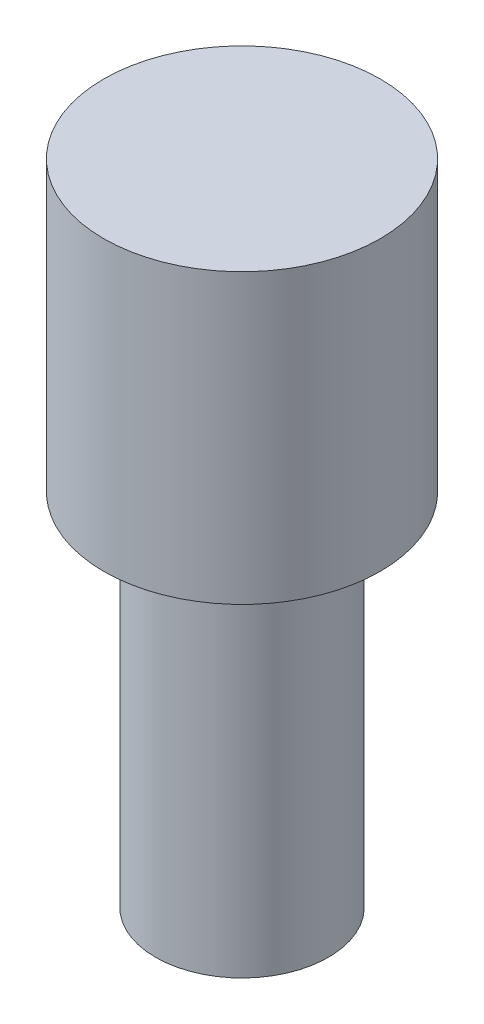
ISO-10303-21;
HEADER;
FILE_DESCRIPTION(('STEP AP214'),'2;1');
FILE_NAME('part.step','',(''),(''),'','','');
FILE_SCHEMA(('AUTOMOTIVE_DESIGN { 1 0 10303 214 1 1 1 1 }'));
ENDSEC;
DATA;
#1=APPLICATION_CONTEXT('core data for automotive mechanical design processes');
#2=APPLICATION_PROTOCOL_DEFINITION('international standard','automotive_design',2000,#1);
#3=PRODUCT_CONTEXT('',#1,'mechanical');
#4=PRODUCT('Part','Part','',(#3));
#5=PRODUCT_RELATED_PRODUCT_CATEGORY('part','',(#4));
#6=PRODUCT_DEFINITION_FORMATION('','',#4);
#7=PRODUCT_DEFINITION_CONTEXT('part definition',#1,'design');
#8=PRODUCT_DEFINITION('design','',#6,#7);
#9=PRODUCT_DEFINITION_SHAPE('','',#8);
#10=(LENGTH_UNIT() NAMED_UNIT(*) SI_UNIT(.MILLI.,.METRE.));
#11=(NAMED_UNIT(*) PLANE_ANGLE_UNIT() SI_UNIT($,.RADIAN.));
#12=(NAMED_UNIT(*) SI_UNIT($,.STERADIAN.) SOLID_ANGLE_UNIT());
#13=UNCERTAINTY_MEASURE_WITH_UNIT(LENGTH_MEASURE(1.E-05),#10,'distance_accuracy_value','');
#14=(GEOMETRIC_REPRESENTATION_CONTEXT(3) GLOBAL_UNCERTAINTY_ASSIGNED_CONTEXT((#13)) GLOBAL_UNIT_ASSIGNED_CONTEXT((#10,
#11,#12)) REPRESENTATION_CONTEXT('',''));
#15=CARTESIAN_POINT('',(0.,0.,0.));
#16=DIRECTION('',(0.,0.,1.));
#17=DIRECTION('',(1.,0.,0.));
#18=AXIS2_PLACEMENT_3D('',#15,#16,#17);
#19=CARTESIAN_POINT('',(0.,0.,-1.21920000000001));
#20=DIRECTION('',(0.,1.,0.));
#21=DIRECTION('',(0.,0.,1.));
#22=AXIS2_PLACEMENT_3D('',#19,#20,#21);
#23=PLANE('',#22);
#24=CARTESIAN_POINT('',(0.,0.,0.));
#25=DIRECTION('',(0.,1.,0.));
#26=DIRECTION('',(0.,0.,1.));
#27=AXIS2_PLACEMENT_3D('',#24,#25,#26);
#28=CIRCLE('',#27,1.2192);
#29=CARTESIAN_POINT('',(0.,0.,1.21919999999999));
#30=VERTEX_POINT('',#29);
#31=EDGE_CURVE('E10',#30,#30,#28,.T.);
#32=ORIENTED_EDGE('',*,*,#31,.F.);
#33=EDGE_LOOP('',(#32));
#34=FACE_BOUND('',#33,.T.);
#35=CARTESIAN_POINT('',(0.,0.,0.));
#36=DIRECTION('',(0.,1.,0.));
#37=DIRECTION('',(0.,0.,1.));
#38=AXIS2_PLACEMENT_3D('',#35,#36,#37);
#39=CIRCLE('',#38,0.761999999999997);
#40=CARTESIAN_POINT('',(0.,0.,0.761999999999988));
#41=VERTEX_POINT('',#40);
#42=EDGE_CURVE('E47',#41,#41,#39,.T.);
#43=ORIENTED_EDGE('',*,*,#42,.T.);
#44=EDGE_LOOP('',(#43));
#45=FACE_BOUND('',#44,.T.);
#46=ADVANCED_FACE('F33',(#34,#45),#23,.F.);
#47=CARTESIAN_POINT('',(0.,53.7786417659091,0.));
#48=DIRECTION('',(0.,1.,0.));
#49=DIRECTION('',(0.,0.,1.));
#50=AXIS2_PLACEMENT_3D('',#47,#48,#49);
#51=CYLINDRICAL_SURFACE('',#50,1.2192);
#52=CARTESIAN_POINT('',(0.,2.54,0.));
#53=DIRECTION('',(0.,1.,0.));
#54=DIRECTION('',(0.,0.,1.));
#55=AXIS2_PLACEMENT_3D('',#52,#53,#54);
#56=CIRCLE('',#55,1.2192);
#57=CARTESIAN_POINT('',(0.,2.54,1.21919999999999));
#58=VERTEX_POINT('',#57);
#59=EDGE_CURVE('E39',#58,#58,#56,.T.);
#60=ORIENTED_EDGE('',*,*,#59,.F.);
#61=EDGE_LOOP('',(#60));
#62=FACE_BOUND('',#61,.T.);
#63=ORIENTED_EDGE('',*,*,#31,.T.);
#64=EDGE_LOOP('',(#63));
#65=FACE_BOUND('',#64,.T.);
#66=ADVANCED_FACE('F67',(#62,#65),#51,.T.);
#67=CARTESIAN_POINT('',(0.,2.54,0.));
#68=DIRECTION('',(0.,-1.,0.));
#69=DIRECTION('',(0.,0.,-1.));
#70=AXIS2_PLACEMENT_3D('',#67,#68,#69);
#71=PLANE('',#70);
#72=ORIENTED_EDGE('',*,*,#59,.T.);
#73=EDGE_LOOP('',(#72));
#74=FACE_BOUND('',#73,.T.);
#75=ADVANCED_FACE('F62',(#74),#71,.F.);
#76=CARTESIAN_POINT('',(0.,-3.175,-0.762000000000007));
#77=DIRECTION('',(0.,1.,0.));
#78=DIRECTION('',(0.,0.,1.));
#79=AXIS2_PLACEMENT_3D('',#76,#77,#78);
#80=PLANE('',#79);
#81=CARTESIAN_POINT('',(0.,-3.175,0.));
#82=DIRECTION('',(0.,1.,0.));
#83=DIRECTION('',(0.,0.,1.));
#84=AXIS2_PLACEMENT_3D('',#81,#82,#83);
#85=CIRCLE('',#84,0.761999999999997);
#86=CARTESIAN_POINT('',(0.,-3.175,0.761999999999987));
#87=VERTEX_POINT('',#86);
#88=EDGE_CURVE('E43',#87,#87,#85,.T.);
#89=ORIENTED_EDGE('',*,*,#88,.F.);
#90=EDGE_LOOP('',(#89));
#91=FACE_BOUND('',#90,.T.);
#92=ADVANCED_FACE('F57',(#91),#80,.F.);
#93=CARTESIAN_POINT('',(0.,53.7786417659091,0.));
#94=DIRECTION('',(0.,1.,0.));
#95=DIRECTION('',(0.,0.,1.));
#96=AXIS2_PLACEMENT_3D('',#93,#94,#95);
#97=CYLINDRICAL_SURFACE('',#96,0.761999999999997);
#98=ORIENTED_EDGE('',*,*,#42,.F.);
#99=EDGE_LOOP('',(#98));
#100=FACE_BOUND('',#99,.T.);
#101=ORIENTED_EDGE('',*,*,#88,.T.);
#102=EDGE_LOOP('',(#101));
#103=FACE_BOUND('',#102,.T.);
#104=ADVANCED_FACE('F54',(#100,#103),#97,.T.);
#105=CLOSED_SHELL('',(#46,#66,#75,#92,#104));
#106=MANIFOLD_SOLID_BREP('B2',#105);
#107=ADVANCED_BREP_SHAPE_REPRESENTATION('',(#18,#106),#14);
#108=SHAPE_DEFINITION_REPRESENTATION(#9,#107);
ENDSEC;
END-ISO-10303-21;
